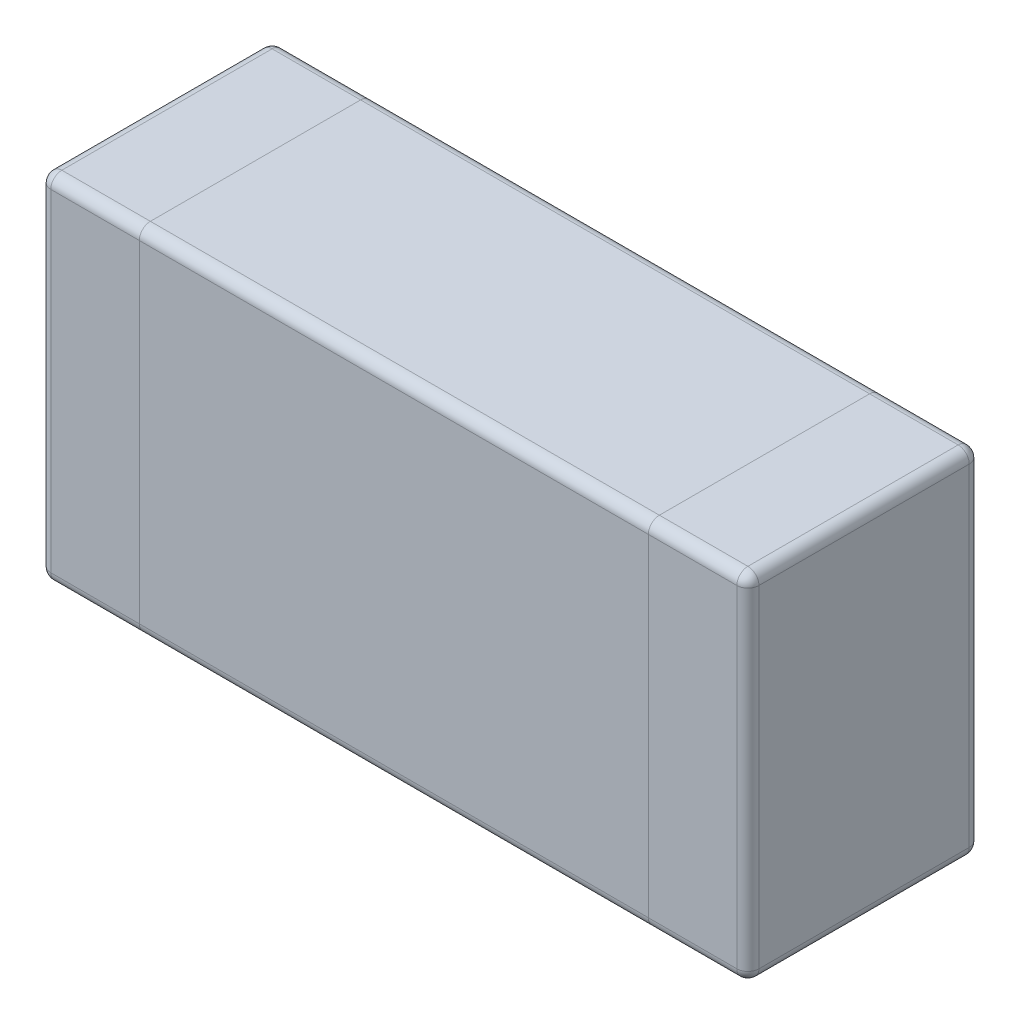
ISO-10303-21;
HEADER;
FILE_DESCRIPTION(('STEP AP214'),'2;1');
FILE_NAME('part.step','',(''),(''),'','','');
FILE_SCHEMA(('AUTOMOTIVE_DESIGN { 1 0 10303 214 1 1 1 1 }'));
ENDSEC;
DATA;
#1=APPLICATION_CONTEXT('core data for automotive mechanical design processes');
#2=APPLICATION_PROTOCOL_DEFINITION('international standard','automotive_design',2000,#1);
#3=PRODUCT_CONTEXT('',#1,'mechanical');
#4=PRODUCT('Part','Part','',(#3));
#5=PRODUCT_RELATED_PRODUCT_CATEGORY('part','',(#4));
#6=PRODUCT_DEFINITION_FORMATION('','',#4);
#7=PRODUCT_DEFINITION_CONTEXT('part definition',#1,'design');
#8=PRODUCT_DEFINITION('design','',#6,#7);
#9=PRODUCT_DEFINITION_SHAPE('','',#8);
#10=(LENGTH_UNIT() NAMED_UNIT(*) SI_UNIT(.MILLI.,.METRE.));
#11=(NAMED_UNIT(*) PLANE_ANGLE_UNIT() SI_UNIT($,.RADIAN.));
#12=(NAMED_UNIT(*) SI_UNIT($,.STERADIAN.) SOLID_ANGLE_UNIT());
#13=UNCERTAINTY_MEASURE_WITH_UNIT(LENGTH_MEASURE(1.E-05),#10,'distance_accuracy_value','');
#14=(GEOMETRIC_REPRESENTATION_CONTEXT(3) GLOBAL_UNCERTAINTY_ASSIGNED_CONTEXT((#13)) GLOBAL_UNIT_ASSIGNED_CONTEXT((#10,
#11,#12)) REPRESENTATION_CONTEXT('',''));
#15=CARTESIAN_POINT('',(0.,0.,0.));
#16=DIRECTION('',(0.,0.,1.));
#17=DIRECTION('',(1.,0.,0.));
#18=AXIS2_PLACEMENT_3D('',#15,#16,#17);
#19=CARTESIAN_POINT('',(1.55,0.749999999999718,1.0500000000002));
#20=DIRECTION('',(0.,2.68882138776405E-13,-1.));
#21=DIRECTION('',(0.,1.,2.68882138776405E-13));
#22=AXIS2_PLACEMENT_3D('',#19,#20,#21);
#23=CYLINDRICAL_SURFACE('',#22,0.05);
#24=CARTESIAN_POINT('',(1.55,0.749999999999731,1.0000000000002));
#25=DIRECTION('',(0.,2.68882138776405E-13,-1.));
#26=DIRECTION('',(0.,-1.,-2.68882138776405E-13));
#27=AXIS2_PLACEMENT_3D('',#24,#25,#26);
#28=CIRCLE('',#27,0.05);
#29=CARTESIAN_POINT('',(1.55,0.799999999999731,1.00000000000021));
#30=VERTEX_POINT('',#29);
#31=CARTESIAN_POINT('',(1.6,0.749999999999731,1.0000000000002));
#32=VERTEX_POINT('',#31);
#33=EDGE_CURVE('E25',#30,#32,#28,.T.);
#34=ORIENTED_EDGE('',*,*,#33,.T.);
#35=DIRECTION('',(0.,-2.68736422004423E-13,1.));
#36=VECTOR('',#35,1.);
#37=CARTESIAN_POINT('',(1.6,0.749999999999718,1.0500000000002));
#38=LINE('',#37,#36);
#39=CARTESIAN_POINT('',(1.6,0.749999999999987,0.0500000000002015));
#40=VERTEX_POINT('',#39);
#41=EDGE_CURVE('E376',#40,#32,#38,.T.);
#42=ORIENTED_EDGE('',*,*,#41,.F.);
#43=CARTESIAN_POINT('',(1.55,0.749999999999987,0.0500000000002015));
#44=DIRECTION('',(0.,-2.68746613504845E-13,1.));
#45=DIRECTION('',(0.,1.,2.68746613504845E-13));
#46=AXIS2_PLACEMENT_3D('',#43,#44,#45);
#47=CIRCLE('',#46,0.05);
#48=CARTESIAN_POINT('',(1.55,0.799999999999987,0.0500000000002149));
#49=VERTEX_POINT('',#48);
#50=EDGE_CURVE('E11',#40,#49,#47,.T.);
#51=ORIENTED_EDGE('',*,*,#50,.T.);
#52=DIRECTION('',(0.,2.68736422004423E-13,-1.));
#53=VECTOR('',#52,1.);
#54=CARTESIAN_POINT('',(1.55,0.799999999999718,1.05000000000021));
#55=LINE('',#54,#53);
#56=EDGE_CURVE('E277',#30,#49,#55,.T.);
#57=ORIENTED_EDGE('',*,*,#56,.F.);
#58=EDGE_LOOP('',(#34,#42,#51,#57));
#59=FACE_BOUND('',#58,.T.);
#60=ADVANCED_FACE('F17',(#59),#23,.T.);
#61=CARTESIAN_POINT('',(1.55,0.749999999999987,0.0500000000002016));
#62=DIRECTION('',(0.,-2.68736422004423E-13,1.));
#63=DIRECTION('',(1.,0.,0.));
#64=AXIS2_PLACEMENT_3D('',#61,#62,#63);
#65=SPHERICAL_SURFACE('',#64,0.05);
#66=CARTESIAN_POINT('',(1.55,0.749999999999987,0.0500000000002015));
#67=DIRECTION('',(0.,1.,2.68736422004423E-13));
#68=DIRECTION('',(-1.,0.,0.));
#69=AXIS2_PLACEMENT_3D('',#66,#67,#68);
#70=CIRCLE('',#69,0.05);
#71=CARTESIAN_POINT('',(1.55,0.75,2.01552316503317E-13));
#72=VERTEX_POINT('',#71);
#73=EDGE_CURVE('E428',#40,#72,#70,.T.);
#74=ORIENTED_EDGE('',*,*,#73,.T.);
#75=CARTESIAN_POINT('',(1.55,0.749999999999987,0.0500000000002016));
#76=DIRECTION('',(1.,0.,0.));
#77=DIRECTION('',(0.,1.,2.68746613504845E-13));
#78=AXIS2_PLACEMENT_3D('',#75,#76,#77);
#79=CIRCLE('',#78,0.05);
#80=EDGE_CURVE('E367',#72,#49,#79,.T.);
#81=ORIENTED_EDGE('',*,*,#80,.T.);
#82=ORIENTED_EDGE('',*,*,#50,.F.);
#83=EDGE_LOOP('',(#74,#81,#82));
#84=FACE_BOUND('',#83,.T.);
#85=ADVANCED_FACE('F467',(#84),#65,.T.);
#86=CARTESIAN_POINT('',(1.55,0.749999999999731,1.0000000000002));
#87=DIRECTION('',(0.,-2.68736422004423E-13,1.));
#88=DIRECTION('',(1.,0.,0.));
#89=AXIS2_PLACEMENT_3D('',#86,#87,#88);
#90=SPHERICAL_SURFACE('',#89,0.05);
#91=CARTESIAN_POINT('',(1.55,0.749999999999731,1.0000000000002));
#92=DIRECTION('',(1.,0.,0.));
#93=DIRECTION('',(0.,-2.68882138776406E-13,1.));
#94=AXIS2_PLACEMENT_3D('',#91,#92,#93);
#95=CIRCLE('',#94,0.05);
#96=CARTESIAN_POINT('',(1.55,0.749999999999718,1.0500000000002));
#97=VERTEX_POINT('',#96);
#98=EDGE_CURVE('E343',#30,#97,#95,.T.);
#99=ORIENTED_EDGE('',*,*,#98,.T.);
#100=CARTESIAN_POINT('',(1.55,0.749999999999731,1.0000000000002));
#101=DIRECTION('',(0.,1.,2.68736422004423E-13));
#102=DIRECTION('',(-1.,0.,0.));
#103=AXIS2_PLACEMENT_3D('',#100,#101,#102);
#104=CIRCLE('',#103,0.05);
#105=EDGE_CURVE('E431',#97,#32,#104,.T.);
#106=ORIENTED_EDGE('',*,*,#105,.T.);
#107=ORIENTED_EDGE('',*,*,#33,.F.);
#108=EDGE_LOOP('',(#99,#106,#107));
#109=FACE_BOUND('',#108,.T.);
#110=ADVANCED_FACE('F454',(#109),#90,.T.);
#111=CARTESIAN_POINT('',(1.55,-0.800000000000014,0.0499999999997849));
#112=DIRECTION('',(0.,-1.,-2.68736422004423E-13));
#113=DIRECTION('',(1.,0.,0.));
#114=AXIS2_PLACEMENT_3D('',#111,#112,#113);
#115=CYLINDRICAL_SURFACE('',#114,0.05);
#116=CARTESIAN_POINT('',(1.55,-0.750000000000014,0.0499999999997985));
#117=DIRECTION('',(0.,1.,2.68736422004423E-13));
#118=DIRECTION('',(1.,0.,0.));
#119=AXIS2_PLACEMENT_3D('',#116,#117,#118);
#120=CIRCLE('',#119,0.05);
#121=CARTESIAN_POINT('',(1.6,-0.750000000000014,0.0499999999997984));
#122=VERTEX_POINT('',#121);
#123=CARTESIAN_POINT('',(1.55,-0.75,-2.01552316503317E-13));
#124=VERTEX_POINT('',#123);
#125=EDGE_CURVE('E143',#122,#124,#120,.T.);
#126=ORIENTED_EDGE('',*,*,#125,.T.);
#127=DIRECTION('',(0.,-1.,-2.68736422004423E-13));
#128=VECTOR('',#127,1.);
#129=CARTESIAN_POINT('',(1.55,-0.8,-2.14989137603538E-13));
#130=LINE('',#129,#128);
#131=EDGE_CURVE('E279',#72,#124,#130,.T.);
#132=ORIENTED_EDGE('',*,*,#131,.F.);
#133=ORIENTED_EDGE('',*,*,#73,.F.);
#134=DIRECTION('',(0.,1.,2.68736422004423E-13));
#135=VECTOR('',#134,1.);
#136=CARTESIAN_POINT('',(1.6,0.799999999999987,0.0500000000002149));
#137=LINE('',#136,#135);
#138=EDGE_CURVE('E309',#122,#40,#137,.T.);
#139=ORIENTED_EDGE('',*,*,#138,.F.);
#140=EDGE_LOOP('',(#126,#132,#133,#139));
#141=FACE_BOUND('',#140,.T.);
#142=ADVANCED_FACE('F463',(#141),#115,.T.);
#143=CARTESIAN_POINT('',(-1.6,0.749999999999987,0.0500000000002015));
#144=DIRECTION('',(1.,0.,0.));
#145=DIRECTION('',(0.,1.,2.68746613504845E-13));
#146=AXIS2_PLACEMENT_3D('',#143,#144,#145);
#147=CYLINDRICAL_SURFACE('',#146,0.05);
#148=CARTESIAN_POINT('',(-1.15,0.749999999999987,0.0500000000002015));
#149=DIRECTION('',(-1.,0.,0.));
#150=DIRECTION('',(0.,1.,2.68746613504845E-13));
#151=AXIS2_PLACEMENT_3D('',#148,#149,#150);
#152=CIRCLE('',#151,0.05);
#153=CARTESIAN_POINT('',(-1.15,0.799999999999987,0.0500000000002149));
#154=VERTEX_POINT('',#153);
#155=CARTESIAN_POINT('',(-1.15,0.75,2.01552316503317E-13));
#156=VERTEX_POINT('',#155);
#157=EDGE_CURVE('E351',#154,#156,#152,.T.);
#158=ORIENTED_EDGE('',*,*,#157,.F.);
#159=DIRECTION('',(-1.,0.,0.));
#160=VECTOR('',#159,1.);
#161=CARTESIAN_POINT('',(-1.6,0.799999999999987,0.0500000000002149));
#162=LINE('',#161,#160);
#163=CARTESIAN_POINT('',(1.15,0.799999999999987,0.0500000000002149));
#164=VERTEX_POINT('',#163);
#165=EDGE_CURVE('E313',#164,#154,#162,.T.);
#166=ORIENTED_EDGE('',*,*,#165,.F.);
#167=CARTESIAN_POINT('',(1.15,0.749999999999987,0.0500000000002015));
#168=DIRECTION('',(1.,0.,0.));
#169=DIRECTION('',(0.,-1.,-2.68746613504845E-13));
#170=AXIS2_PLACEMENT_3D('',#167,#168,#169);
#171=CIRCLE('',#170,0.05);
#172=CARTESIAN_POINT('',(1.15,0.75,2.01552316503317E-13));
#173=VERTEX_POINT('',#172);
#174=EDGE_CURVE('E359',#173,#164,#171,.T.);
#175=ORIENTED_EDGE('',*,*,#174,.F.);
#176=DIRECTION('',(1.,0.,0.));
#177=VECTOR('',#176,1.);
#178=CARTESIAN_POINT('',(1.6,0.75,2.01552316503317E-13));
#179=LINE('',#178,#177);
#180=EDGE_CURVE('E397',#156,#173,#179,.T.);
#181=ORIENTED_EDGE('',*,*,#180,.F.);
#182=EDGE_LOOP('',(#158,#166,#175,#181));
#183=FACE_BOUND('',#182,.T.);
#184=ADVANCED_FACE('F1278',(#183),#147,.T.);
#185=CARTESIAN_POINT('',(1.6,0.749999999999731,1.0000000000002));
#186=DIRECTION('',(-1.,0.,0.));
#187=DIRECTION('',(0.,-1.,-2.68882138776405E-13));
#188=AXIS2_PLACEMENT_3D('',#185,#186,#187);
#189=CYLINDRICAL_SURFACE('',#188,0.05);
#190=CARTESIAN_POINT('',(-1.15,0.749999999999731,1.0000000000002));
#191=DIRECTION('',(-1.,0.,0.));
#192=DIRECTION('',(0.,1.,2.68882138776405E-13));
#193=AXIS2_PLACEMENT_3D('',#190,#191,#192);
#194=CIRCLE('',#193,0.05);
#195=CARTESIAN_POINT('',(-1.15,0.749999999999718,1.0500000000002));
#196=VERTEX_POINT('',#195);
#197=CARTESIAN_POINT('',(-1.15,0.799999999999731,1.00000000000021));
#198=VERTEX_POINT('',#197);
#199=EDGE_CURVE('E283',#196,#198,#194,.T.);
#200=ORIENTED_EDGE('',*,*,#199,.F.);
#201=DIRECTION('',(-1.,0.,0.));
#202=VECTOR('',#201,1.);
#203=CARTESIAN_POINT('',(1.6,0.749999999999718,1.0500000000002));
#204=LINE('',#203,#202);
#205=CARTESIAN_POINT('',(1.15,0.749999999999718,1.0500000000002));
#206=VERTEX_POINT('',#205);
#207=EDGE_CURVE('E227',#206,#196,#204,.T.);
#208=ORIENTED_EDGE('',*,*,#207,.F.);
#209=CARTESIAN_POINT('',(1.15,0.749999999999731,1.0000000000002));
#210=DIRECTION('',(1.,0.,0.));
#211=DIRECTION('',(0.,-1.,-2.68882138776405E-13));
#212=AXIS2_PLACEMENT_3D('',#209,#210,#211);
#213=CIRCLE('',#212,0.05);
#214=CARTESIAN_POINT('',(1.15,0.799999999999731,1.00000000000021));
#215=VERTEX_POINT('',#214);
#216=EDGE_CURVE('E339',#215,#206,#213,.T.);
#217=ORIENTED_EDGE('',*,*,#216,.F.);
#218=DIRECTION('',(1.,0.,0.));
#219=VECTOR('',#218,1.);
#220=CARTESIAN_POINT('',(-1.6,0.799999999999731,1.00000000000021));
#221=LINE('',#220,#219);
#222=EDGE_CURVE('E335',#198,#215,#221,.T.);
#223=ORIENTED_EDGE('',*,*,#222,.F.);
#224=EDGE_LOOP('',(#200,#208,#217,#223));
#225=FACE_BOUND('',#224,.T.);
#226=ADVANCED_FACE('F1270',(#225),#189,.T.);
#227=CARTESIAN_POINT('',(1.55,0.799999999999731,1.00000000000021));
#228=DIRECTION('',(0.,1.,2.68736422004423E-13));
#229=DIRECTION('',(-1.,0.,0.));
#230=AXIS2_PLACEMENT_3D('',#227,#228,#229);
#231=CYLINDRICAL_SURFACE('',#230,0.05);
#232=CARTESIAN_POINT('',(1.55,-0.750000000000269,0.999999999999799));
#233=DIRECTION('',(0.,1.,2.71050543121376E-13));
#234=DIRECTION('',(0.,2.71050543121376E-13,-1.));
#235=AXIS2_PLACEMENT_3D('',#232,#233,#234);
#236=CIRCLE('',#235,0.05);
#237=CARTESIAN_POINT('',(1.55,-0.750000000000283,1.0499999999998));
#238=VERTEX_POINT('',#237);
#239=CARTESIAN_POINT('',(1.6,-0.750000000000269,0.999999999999799));
#240=VERTEX_POINT('',#239);
#241=EDGE_CURVE('E157',#238,#240,#236,.T.);
#242=ORIENTED_EDGE('',*,*,#241,.T.);
#243=DIRECTION('',(0.,-1.,-2.68736422004423E-13));
#244=VECTOR('',#243,1.);
#245=CARTESIAN_POINT('',(1.6,-0.800000000000269,0.999999999999786));
#246=LINE('',#245,#244);
#247=EDGE_CURVE('E375',#32,#240,#246,.T.);
#248=ORIENTED_EDGE('',*,*,#247,.F.);
#249=ORIENTED_EDGE('',*,*,#105,.F.);
#250=DIRECTION('',(0.,1.,2.68736422004423E-13));
#251=VECTOR('',#250,1.);
#252=CARTESIAN_POINT('',(1.55,0.799999999999718,1.05000000000021));
#253=LINE('',#252,#251);
#254=EDGE_CURVE('E488',#238,#97,#253,.T.);
#255=ORIENTED_EDGE('',*,*,#254,.F.);
#256=EDGE_LOOP('',(#242,#248,#249,#255));
#257=FACE_BOUND('',#256,.T.);
#258=ADVANCED_FACE('F456',(#257),#231,.T.);
#259=CARTESIAN_POINT('',(1.55,-0.750000000000014,0.0499999999997985));
#260=DIRECTION('',(0.,-2.68736422004423E-13,1.));
#261=DIRECTION('',(1.,0.,0.));
#262=AXIS2_PLACEMENT_3D('',#259,#260,#261);
#263=SPHERICAL_SURFACE('',#262,0.05);
#264=CARTESIAN_POINT('',(1.55,-0.750000000000014,0.0499999999997984));
#265=DIRECTION('',(0.,2.68746613504845E-13,-1.));
#266=DIRECTION('',(0.,1.,2.68746613504845E-13));
#267=AXIS2_PLACEMENT_3D('',#264,#265,#266);
#268=CIRCLE('',#267,0.05);
#269=CARTESIAN_POINT('',(1.55,-0.800000000000014,0.0499999999997849));
#270=VERTEX_POINT('',#269);
#271=EDGE_CURVE('E437',#122,#270,#268,.T.);
#272=ORIENTED_EDGE('',*,*,#271,.T.);
#273=CARTESIAN_POINT('',(1.55,-0.750000000000014,0.0499999999997984));
#274=DIRECTION('',(1.,0.,0.));
#275=DIRECTION('',(0.,1.,2.68746613504845E-13));
#276=AXIS2_PLACEMENT_3D('',#273,#274,#275);
#277=CIRCLE('',#276,0.05);
#278=EDGE_CURVE('E246',#270,#124,#277,.T.);
#279=ORIENTED_EDGE('',*,*,#278,.T.);
#280=ORIENTED_EDGE('',*,*,#125,.F.);
#281=EDGE_LOOP('',(#272,#279,#280));
#282=FACE_BOUND('',#281,.T.);
#283=ADVANCED_FACE('F1147',(#282),#263,.T.);
#284=CARTESIAN_POINT('',(-1.55,0.749999999999987,0.0500000000002016));
#285=DIRECTION('',(0.,-2.68736422004423E-13,1.));
#286=DIRECTION('',(1.,0.,0.));
#287=AXIS2_PLACEMENT_3D('',#284,#285,#286);
#288=SPHERICAL_SURFACE('',#287,0.05);
#289=CARTESIAN_POINT('',(-1.55,0.749999999999987,0.0500000000002016));
#290=DIRECTION('',(0.,1.,2.68736422004423E-13));
#291=DIRECTION('',(-1.,0.,0.));
#292=AXIS2_PLACEMENT_3D('',#289,#290,#291);
#293=CIRCLE('',#292,0.05);
#294=CARTESIAN_POINT('',(-1.55,0.75,2.01552316503317E-13));
#295=VERTEX_POINT('',#294);
#296=CARTESIAN_POINT('',(-1.6,0.749999999999987,0.0500000000002015));
#297=VERTEX_POINT('',#296);
#298=EDGE_CURVE('E38',#295,#297,#293,.T.);
#299=ORIENTED_EDGE('',*,*,#298,.T.);
#300=CARTESIAN_POINT('',(-1.55,0.749999999999987,0.0500000000002015));
#301=DIRECTION('',(0.,2.68746613504845E-13,-1.));
#302=DIRECTION('',(0.,1.,2.68746613504845E-13));
#303=AXIS2_PLACEMENT_3D('',#300,#301,#302);
#304=CIRCLE('',#303,0.05);
#305=CARTESIAN_POINT('',(-1.55,0.799999999999987,0.0500000000002149));
#306=VERTEX_POINT('',#305);
#307=EDGE_CURVE('E385',#297,#306,#304,.T.);
#308=ORIENTED_EDGE('',*,*,#307,.T.);
#309=CARTESIAN_POINT('',(-1.55,0.749999999999987,0.0500000000002015));
#310=DIRECTION('',(1.,0.,0.));
#311=DIRECTION('',(0.,-1.,-2.68746613504845E-13));
#312=AXIS2_PLACEMENT_3D('',#309,#310,#311);
#313=CIRCLE('',#312,0.05);
#314=EDGE_CURVE('E355',#295,#306,#313,.T.);
#315=ORIENTED_EDGE('',*,*,#314,.F.);
#316=EDGE_LOOP('',(#299,#308,#315));
#317=FACE_BOUND('',#316,.T.);
#318=ADVANCED_FACE('F572',(#317),#288,.T.);
#319=CARTESIAN_POINT('',(-1.55,0.749999999999731,1.0000000000002));
#320=DIRECTION('',(0.,-2.68736422004423E-13,1.));
#321=DIRECTION('',(1.,0.,0.));
#322=AXIS2_PLACEMENT_3D('',#319,#320,#321);
#323=SPHERICAL_SURFACE('',#322,0.05);
#324=CARTESIAN_POINT('',(-1.55,0.749999999999731,1.0000000000002));
#325=DIRECTION('',(0.,-2.68882138776405E-13,1.));
#326=DIRECTION('',(0.,-1.,-2.68882138776405E-13));
#327=AXIS2_PLACEMENT_3D('',#324,#325,#326);
#328=CIRCLE('',#327,0.05);
#329=CARTESIAN_POINT('',(-1.55,0.799999999999731,1.00000000000021));
#330=VERTEX_POINT('',#329);
#331=CARTESIAN_POINT('',(-1.6,0.749999999999732,1.0000000000002));
#332=VERTEX_POINT('',#331);
#333=EDGE_CURVE('E52',#330,#332,#328,.T.);
#334=ORIENTED_EDGE('',*,*,#333,.T.);
#335=CARTESIAN_POINT('',(-1.55,0.749999999999732,1.0000000000002));
#336=DIRECTION('',(0.,1.,2.71050543121376E-13));
#337=DIRECTION('',(0.,-2.71050543121376E-13,1.));
#338=AXIS2_PLACEMENT_3D('',#335,#336,#337);
#339=CIRCLE('',#338,0.05);
#340=CARTESIAN_POINT('',(-1.55,0.749999999999718,1.0500000000002));
#341=VERTEX_POINT('',#340);
#342=EDGE_CURVE('E268',#332,#341,#339,.T.);
#343=ORIENTED_EDGE('',*,*,#342,.T.);
#344=CARTESIAN_POINT('',(-1.55,0.749999999999731,1.0000000000002));
#345=DIRECTION('',(1.,0.,0.));
#346=DIRECTION('',(0.,-1.,-2.68882138776405E-13));
#347=AXIS2_PLACEMENT_3D('',#344,#345,#346);
#348=CIRCLE('',#347,0.05);
#349=EDGE_CURVE('E325',#330,#341,#348,.T.);
#350=ORIENTED_EDGE('',*,*,#349,.F.);
#351=EDGE_LOOP('',(#334,#343,#350));
#352=FACE_BOUND('',#351,.T.);
#353=ADVANCED_FACE('F1247',(#352),#323,.T.);
#354=CARTESIAN_POINT('',(1.55,-0.750000000000269,0.999999999999799));
#355=DIRECTION('',(0.,-2.68736422004423E-13,1.));
#356=DIRECTION('',(1.,0.,0.));
#357=AXIS2_PLACEMENT_3D('',#354,#355,#356);
#358=SPHERICAL_SURFACE('',#357,0.05);
#359=CARTESIAN_POINT('',(1.55,-0.750000000000269,0.999999999999799));
#360=DIRECTION('',(1.,0.,0.));
#361=DIRECTION('',(0.,1.,2.68882138776405E-13));
#362=AXIS2_PLACEMENT_3D('',#359,#360,#361);
#363=CIRCLE('',#362,0.05);
#364=CARTESIAN_POINT('',(1.55,-0.800000000000269,0.999999999999786));
#365=VERTEX_POINT('',#364);
#366=EDGE_CURVE('E515',#238,#365,#363,.T.);
#367=ORIENTED_EDGE('',*,*,#366,.T.);
#368=CARTESIAN_POINT('',(1.55,-0.750000000000269,0.999999999999799));
#369=DIRECTION('',(0.,-2.68882138776405E-13,1.));
#370=DIRECTION('',(0.,-1.,-2.68882138776405E-13));
#371=AXIS2_PLACEMENT_3D('',#368,#369,#370);
#372=CIRCLE('',#371,0.05);
#373=EDGE_CURVE('E434',#365,#240,#372,.T.);
#374=ORIENTED_EDGE('',*,*,#373,.T.);
#375=ORIENTED_EDGE('',*,*,#241,.F.);
#376=EDGE_LOOP('',(#367,#374,#375));
#377=FACE_BOUND('',#376,.T.);
#378=ADVANCED_FACE('F1238',(#377),#358,.T.);
#379=CARTESIAN_POINT('',(1.55,-0.750000000000283,1.0499999999998));
#380=DIRECTION('',(0.,2.68882138776405E-13,-1.));
#381=DIRECTION('',(0.,1.,2.68882138776405E-13));
#382=AXIS2_PLACEMENT_3D('',#379,#380,#381);
#383=CYLINDRICAL_SURFACE('',#382,0.05);
#384=ORIENTED_EDGE('',*,*,#373,.F.);
#385=DIRECTION('',(0.,-2.68736422004423E-13,1.));
#386=VECTOR('',#385,1.);
#387=CARTESIAN_POINT('',(1.55,-0.800000000000282,1.04999999999979));
#388=LINE('',#387,#386);
#389=EDGE_CURVE('E251',#270,#365,#388,.T.);
#390=ORIENTED_EDGE('',*,*,#389,.F.);
#391=ORIENTED_EDGE('',*,*,#271,.F.);
#392=DIRECTION('',(0.,2.68736422004423E-13,-1.));
#393=VECTOR('',#392,1.);
#394=CARTESIAN_POINT('',(1.6,-0.750000000000283,1.0499999999998));
#395=LINE('',#394,#393);
#396=EDGE_CURVE('E314',#240,#122,#395,.T.);
#397=ORIENTED_EDGE('',*,*,#396,.F.);
#398=EDGE_LOOP('',(#384,#390,#391,#397));
#399=FACE_BOUND('',#398,.T.);
#400=ADVANCED_FACE('F1230',(#399),#383,.T.);
#401=CARTESIAN_POINT('',(-1.6,-0.750000000000014,0.0499999999997984));
#402=DIRECTION('',(-1.,0.,0.));
#403=DIRECTION('',(0.,-1.,-2.68746613504845E-13));
#404=AXIS2_PLACEMENT_3D('',#401,#402,#403);
#405=CYLINDRICAL_SURFACE('',#404,0.05);
#406=CARTESIAN_POINT('',(-1.15,-0.750000000000014,0.0499999999997984));
#407=DIRECTION('',(-1.,0.,0.));
#408=DIRECTION('',(0.,1.,2.68746613504845E-13));
#409=AXIS2_PLACEMENT_3D('',#406,#407,#408);
#410=CIRCLE('',#409,0.05);
#411=CARTESIAN_POINT('',(-1.15,-0.75,-2.01552316503317E-13));
#412=VERTEX_POINT('',#411);
#413=CARTESIAN_POINT('',(-1.15,-0.800000000000014,0.0499999999997849));
#414=VERTEX_POINT('',#413);
#415=EDGE_CURVE('E288',#412,#414,#410,.T.);
#416=ORIENTED_EDGE('',*,*,#415,.F.);
#417=DIRECTION('',(-1.,0.,0.));
#418=VECTOR('',#417,1.);
#419=CARTESIAN_POINT('',(-1.6,-0.75,-2.01552316503317E-13));
#420=LINE('',#419,#418);
#421=CARTESIAN_POINT('',(1.15,-0.75,-2.01552316503317E-13));
#422=VERTEX_POINT('',#421);
#423=EDGE_CURVE('E234',#422,#412,#420,.T.);
#424=ORIENTED_EDGE('',*,*,#423,.F.);
#425=CARTESIAN_POINT('',(1.15,-0.750000000000014,0.0499999999997984));
#426=DIRECTION('',(1.,0.,0.));
#427=DIRECTION('',(0.,-1.,-2.68746613504845E-13));
#428=AXIS2_PLACEMENT_3D('',#425,#426,#427);
#429=CIRCLE('',#428,0.05);
#430=CARTESIAN_POINT('',(1.15,-0.800000000000014,0.0499999999997849));
#431=VERTEX_POINT('',#430);
#432=EDGE_CURVE('E231',#431,#422,#429,.T.);
#433=ORIENTED_EDGE('',*,*,#432,.F.);
#434=DIRECTION('',(1.,0.,0.));
#435=VECTOR('',#434,1.);
#436=CARTESIAN_POINT('',(1.6,-0.800000000000014,0.0499999999997849));
#437=LINE('',#436,#435);
#438=EDGE_CURVE('E214',#414,#431,#437,.T.);
#439=ORIENTED_EDGE('',*,*,#438,.F.);
#440=EDGE_LOOP('',(#416,#424,#433,#439));
#441=FACE_BOUND('',#440,.T.);
#442=ADVANCED_FACE('F233',(#441),#405,.T.);
#443=CARTESIAN_POINT('',(-1.55,-0.800000000000014,0.0499999999997849));
#444=DIRECTION('',(0.,1.,2.68736422004423E-13));
#445=DIRECTION('',(-1.,0.,0.));
#446=AXIS2_PLACEMENT_3D('',#443,#444,#445);
#447=CYLINDRICAL_SURFACE('',#446,0.05);
#448=CARTESIAN_POINT('',(-1.55,-0.750000000000014,0.0499999999997984));
#449=DIRECTION('',(0.,1.,2.68736422004423E-13));
#450=DIRECTION('',(1.,0.,0.));
#451=AXIS2_PLACEMENT_3D('',#448,#449,#450);
#452=CIRCLE('',#451,0.05);
#453=CARTESIAN_POINT('',(-1.55,-0.75,-2.01552316503317E-13));
#454=VERTEX_POINT('',#453);
#455=CARTESIAN_POINT('',(-1.6,-0.750000000000014,0.0499999999997984));
#456=VERTEX_POINT('',#455);
#457=EDGE_CURVE('E425',#454,#456,#452,.T.);
#458=ORIENTED_EDGE('',*,*,#457,.T.);
#459=DIRECTION('',(0.,-1.,-2.68736422004423E-13));
#460=VECTOR('',#459,1.);
#461=CARTESIAN_POINT('',(-1.6,-0.800000000000014,0.0499999999997849));
#462=LINE('',#461,#460);
#463=EDGE_CURVE('E410',#297,#456,#462,.T.);
#464=ORIENTED_EDGE('',*,*,#463,.F.);
#465=ORIENTED_EDGE('',*,*,#298,.F.);
#466=DIRECTION('',(0.,1.,2.68736422004423E-13));
#467=VECTOR('',#466,1.);
#468=CARTESIAN_POINT('',(-1.55,0.8,2.14989137603538E-13));
#469=LINE('',#468,#467);
#470=EDGE_CURVE('E304',#454,#295,#469,.T.);
#471=ORIENTED_EDGE('',*,*,#470,.F.);
#472=EDGE_LOOP('',(#458,#464,#465,#471));
#473=FACE_BOUND('',#472,.T.);
#474=ADVANCED_FACE('F1184',(#473),#447,.T.);
#475=CARTESIAN_POINT('',(-1.55,0.749999999999718,1.0500000000002));
#476=DIRECTION('',(0.,2.68882138776405E-13,-1.));
#477=DIRECTION('',(0.,1.,2.68882138776405E-13));
#478=AXIS2_PLACEMENT_3D('',#475,#476,#477);
#479=CYLINDRICAL_SURFACE('',#478,0.05);
#480=ORIENTED_EDGE('',*,*,#307,.F.);
#481=DIRECTION('',(0.,2.68736422004423E-13,-1.));
#482=VECTOR('',#481,1.);
#483=CARTESIAN_POINT('',(-1.6,0.749999999999718,1.0500000000002));
#484=LINE('',#483,#482);
#485=EDGE_CURVE('E406',#332,#297,#484,.T.);
#486=ORIENTED_EDGE('',*,*,#485,.F.);
#487=ORIENTED_EDGE('',*,*,#333,.F.);
#488=DIRECTION('',(0.,-2.68736422004423E-13,1.));
#489=VECTOR('',#488,1.);
#490=CARTESIAN_POINT('',(-1.55,0.799999999999718,1.05000000000021));
#491=LINE('',#490,#489);
#492=EDGE_CURVE('E278',#306,#330,#491,.T.);
#493=ORIENTED_EDGE('',*,*,#492,.F.);
#494=EDGE_LOOP('',(#480,#486,#487,#493));
#495=FACE_BOUND('',#494,.T.);
#496=ADVANCED_FACE('F570',(#495),#479,.T.);
#497=CARTESIAN_POINT('',(-1.55,0.799999999999731,1.00000000000021));
#498=DIRECTION('',(0.,-1.,-2.68736422004423E-13));
#499=DIRECTION('',(1.,0.,0.));
#500=AXIS2_PLACEMENT_3D('',#497,#498,#499);
#501=CYLINDRICAL_SURFACE('',#500,0.05);
#502=CARTESIAN_POINT('',(-1.55,-0.750000000000269,0.999999999999799));
#503=DIRECTION('',(0.,1.,2.68736422004423E-13));
#504=DIRECTION('',(1.,0.,0.));
#505=AXIS2_PLACEMENT_3D('',#502,#503,#504);
#506=CIRCLE('',#505,0.05);
#507=CARTESIAN_POINT('',(-1.6,-0.750000000000269,0.999999999999799));
#508=VERTEX_POINT('',#507);
#509=CARTESIAN_POINT('',(-1.55,-0.750000000000283,1.0499999999998));
#510=VERTEX_POINT('',#509);
#511=EDGE_CURVE('E422',#508,#510,#506,.T.);
#512=ORIENTED_EDGE('',*,*,#511,.T.);
#513=DIRECTION('',(0.,-1.,-2.68736422004423E-13));
#514=VECTOR('',#513,1.);
#515=CARTESIAN_POINT('',(-1.55,0.799999999999718,1.05000000000021));
#516=LINE('',#515,#514);
#517=EDGE_CURVE('E566',#341,#510,#516,.T.);
#518=ORIENTED_EDGE('',*,*,#517,.F.);
#519=ORIENTED_EDGE('',*,*,#342,.F.);
#520=DIRECTION('',(0.,1.,2.68736422004423E-13));
#521=VECTOR('',#520,1.);
#522=CARTESIAN_POINT('',(-1.6,-0.800000000000269,0.999999999999786));
#523=LINE('',#522,#521);
#524=EDGE_CURVE('E334',#508,#332,#523,.T.);
#525=ORIENTED_EDGE('',*,*,#524,.F.);
#526=EDGE_LOOP('',(#512,#518,#519,#525));
#527=FACE_BOUND('',#526,.T.);
#528=ADVANCED_FACE('F563',(#527),#501,.T.);
#529=CARTESIAN_POINT('',(1.6,-0.750000000000269,0.999999999999799));
#530=DIRECTION('',(1.,0.,0.));
#531=DIRECTION('',(0.,1.,2.68882138776405E-13));
#532=AXIS2_PLACEMENT_3D('',#529,#530,#531);
#533=CYLINDRICAL_SURFACE('',#532,0.05);
#534=CARTESIAN_POINT('',(-1.15,-0.750000000000269,0.999999999999799));
#535=DIRECTION('',(-1.,0.,0.));
#536=DIRECTION('',(0.,1.,2.68882138776405E-13));
#537=AXIS2_PLACEMENT_3D('',#534,#535,#536);
#538=CIRCLE('',#537,0.05);
#539=CARTESIAN_POINT('',(-1.15,-0.800000000000269,0.999999999999786));
#540=VERTEX_POINT('',#539);
#541=CARTESIAN_POINT('',(-1.15,-0.750000000000283,1.0499999999998));
#542=VERTEX_POINT('',#541);
#543=EDGE_CURVE('E503',#540,#542,#538,.T.);
#544=ORIENTED_EDGE('',*,*,#543,.F.);
#545=DIRECTION('',(-1.,0.,0.));
#546=VECTOR('',#545,1.);
#547=CARTESIAN_POINT('',(-1.6,-0.800000000000269,0.999999999999786));
#548=LINE('',#547,#546);
#549=CARTESIAN_POINT('',(1.15,-0.800000000000269,0.999999999999786));
#550=VERTEX_POINT('',#549);
#551=EDGE_CURVE('E228',#550,#540,#548,.T.);
#552=ORIENTED_EDGE('',*,*,#551,.F.);
#553=CARTESIAN_POINT('',(1.15,-0.750000000000269,0.999999999999799));
#554=DIRECTION('',(1.,0.,0.));
#555=DIRECTION('',(0.,-1.,-2.68882138776405E-13));
#556=AXIS2_PLACEMENT_3D('',#553,#554,#555);
#557=CIRCLE('',#556,0.05);
#558=CARTESIAN_POINT('',(1.15,-0.750000000000283,1.0499999999998));
#559=VERTEX_POINT('',#558);
#560=EDGE_CURVE('E508',#559,#550,#557,.T.);
#561=ORIENTED_EDGE('',*,*,#560,.F.);
#562=DIRECTION('',(1.,0.,0.));
#563=VECTOR('',#562,1.);
#564=CARTESIAN_POINT('',(1.6,-0.750000000000283,1.0499999999998));
#565=LINE('',#564,#563);
#566=EDGE_CURVE('E400',#542,#559,#565,.T.);
#567=ORIENTED_EDGE('',*,*,#566,.F.);
#568=EDGE_LOOP('',(#544,#552,#561,#567));
#569=FACE_BOUND('',#568,.T.);
#570=ADVANCED_FACE('F592',(#569),#533,.T.);
#571=CARTESIAN_POINT('',(-1.55,-0.750000000000014,0.0499999999997985));
#572=DIRECTION('',(0.,-2.68736422004423E-13,1.));
#573=DIRECTION('',(1.,0.,0.));
#574=AXIS2_PLACEMENT_3D('',#571,#572,#573);
#575=SPHERICAL_SURFACE('',#574,0.05);
#576=CARTESIAN_POINT('',(-1.55,-0.750000000000014,0.0499999999997985));
#577=DIRECTION('',(1.,0.,0.));
#578=DIRECTION('',(0.,-1.,-2.70508442035133E-13));
#579=AXIS2_PLACEMENT_3D('',#576,#577,#578);
#580=CIRCLE('',#579,0.05);
#581=CARTESIAN_POINT('',(-1.55,-0.800000000000014,0.0499999999997849));
#582=VERTEX_POINT('',#581);
#583=EDGE_CURVE('E240',#582,#454,#580,.T.);
#584=ORIENTED_EDGE('',*,*,#583,.F.);
#585=CARTESIAN_POINT('',(-1.55,-0.750000000000014,0.0499999999997984));
#586=DIRECTION('',(0.,2.68746613504845E-13,-1.));
#587=DIRECTION('',(0.,1.,2.68746613504845E-13));
#588=AXIS2_PLACEMENT_3D('',#585,#586,#587);
#589=CIRCLE('',#588,0.05);
#590=EDGE_CURVE('E421',#582,#456,#589,.T.);
#591=ORIENTED_EDGE('',*,*,#590,.T.);
#592=ORIENTED_EDGE('',*,*,#457,.F.);
#593=EDGE_LOOP('',(#584,#591,#592));
#594=FACE_BOUND('',#593,.T.);
#595=ADVANCED_FACE('F547',(#594),#575,.T.);
#596=CARTESIAN_POINT('',(-1.55,-0.750000000000269,0.999999999999799));
#597=DIRECTION('',(0.,-2.68736422004423E-13,1.));
#598=DIRECTION('',(1.,0.,0.));
#599=AXIS2_PLACEMENT_3D('',#596,#597,#598);
#600=SPHERICAL_SURFACE('',#599,0.05);
#601=ORIENTED_EDGE('',*,*,#511,.F.);
#602=CARTESIAN_POINT('',(-1.55,-0.750000000000269,0.999999999999799));
#603=DIRECTION('',(0.,-2.68882138776405E-13,1.));
#604=DIRECTION('',(0.,-1.,-2.68882138776405E-13));
#605=AXIS2_PLACEMENT_3D('',#602,#603,#604);
#606=CIRCLE('',#605,0.05);
#607=CARTESIAN_POINT('',(-1.55,-0.800000000000269,0.999999999999786));
#608=VERTEX_POINT('',#607);
#609=EDGE_CURVE('E418',#508,#608,#606,.T.);
#610=ORIENTED_EDGE('',*,*,#609,.T.);
#611=CARTESIAN_POINT('',(-1.55,-0.750000000000269,0.999999999999799));
#612=DIRECTION('',(1.,0.,0.));
#613=DIRECTION('',(0.,2.68882138776405E-13,-1.));
#614=AXIS2_PLACEMENT_3D('',#611,#612,#613);
#615=CIRCLE('',#614,0.05);
#616=EDGE_CURVE('E510',#510,#608,#615,.T.);
#617=ORIENTED_EDGE('',*,*,#616,.F.);
#618=EDGE_LOOP('',(#601,#610,#617));
#619=FACE_BOUND('',#618,.T.);
#620=ADVANCED_FACE('F1179',(#619),#600,.T.);
#621=CARTESIAN_POINT('',(-1.55,-0.750000000000283,1.0499999999998));
#622=DIRECTION('',(0.,2.68882138776405E-13,-1.));
#623=DIRECTION('',(0.,1.,2.68882138776405E-13));
#624=AXIS2_PLACEMENT_3D('',#621,#622,#623);
#625=CYLINDRICAL_SURFACE('',#624,0.05);
#626=ORIENTED_EDGE('',*,*,#609,.F.);
#627=DIRECTION('',(0.,-2.68736422004423E-13,1.));
#628=VECTOR('',#627,1.);
#629=CARTESIAN_POINT('',(-1.6,-0.750000000000283,1.0499999999998));
#630=LINE('',#629,#628);
#631=EDGE_CURVE('E330',#456,#508,#630,.T.);
#632=ORIENTED_EDGE('',*,*,#631,.F.);
#633=ORIENTED_EDGE('',*,*,#590,.F.);
#634=DIRECTION('',(0.,2.68736422004423E-13,-1.));
#635=VECTOR('',#634,1.);
#636=CARTESIAN_POINT('',(-1.55,-0.800000000000282,1.04999999999979));
#637=LINE('',#636,#635);
#638=EDGE_CURVE('E265',#608,#582,#637,.T.);
#639=ORIENTED_EDGE('',*,*,#638,.F.);
#640=EDGE_LOOP('',(#626,#632,#633,#639));
#641=FACE_BOUND('',#640,.T.);
#642=ADVANCED_FACE('F558',(#641),#625,.T.);
#643=CARTESIAN_POINT('',(1.6,0.8,2.14989137603538E-13));
#644=DIRECTION('',(0.,2.68736422004423E-13,-1.));
#645=DIRECTION('',(-1.,0.,0.));
#646=AXIS2_PLACEMENT_3D('',#643,#644,#645);
#647=PLANE('',#646);
#648=DIRECTION('',(0.,-1.,-2.68736422004423E-13));
#649=VECTOR('',#648,1.);
#650=CARTESIAN_POINT('',(-1.15,0.8,2.14989137603538E-13));
#651=LINE('',#650,#649);
#652=EDGE_CURVE('E300',#156,#412,#651,.T.);
#653=ORIENTED_EDGE('',*,*,#652,.F.);
#654=ORIENTED_EDGE('',*,*,#180,.T.);
#655=DIRECTION('',(0.,1.,2.68736422004423E-13));
#656=VECTOR('',#655,1.);
#657=CARTESIAN_POINT('',(1.15,0.8,2.14989137603538E-13));
#658=LINE('',#657,#656);
#659=EDGE_CURVE('E308',#422,#173,#658,.T.);
#660=ORIENTED_EDGE('',*,*,#659,.F.);
#661=ORIENTED_EDGE('',*,*,#423,.T.);
#662=EDGE_LOOP('',(#653,#654,#660,#661));
#663=FACE_BOUND('',#662,.T.);
#664=ADVANCED_FACE('F584',(#663),#647,.T.);
#665=CARTESIAN_POINT('',(1.6,0.799999999999718,1.05000000000021));
#666=DIRECTION('',(0.,2.68736422004423E-13,-1.));
#667=DIRECTION('',(-1.,0.,0.));
#668=AXIS2_PLACEMENT_3D('',#665,#666,#667);
#669=PLANE('',#668);
#670=ORIENTED_EDGE('',*,*,#207,.T.);
#671=DIRECTION('',(0.,-1.,-2.68736422004423E-13));
#672=VECTOR('',#671,1.);
#673=CARTESIAN_POINT('',(-1.15,0.799999999999718,1.05000000000021));
#674=LINE('',#673,#672);
#675=EDGE_CURVE('E613',#196,#542,#674,.T.);
#676=ORIENTED_EDGE('',*,*,#675,.T.);
#677=ORIENTED_EDGE('',*,*,#566,.T.);
#678=DIRECTION('',(0.,1.,2.68736422004423E-13));
#679=VECTOR('',#678,1.);
#680=CARTESIAN_POINT('',(1.15,0.799999999999718,1.05000000000021));
#681=LINE('',#680,#679);
#682=EDGE_CURVE('E499',#559,#206,#681,.T.);
#683=ORIENTED_EDGE('',*,*,#682,.T.);
#684=EDGE_LOOP('',(#670,#676,#677,#683));
#685=FACE_BOUND('',#684,.T.);
#686=ADVANCED_FACE('F620',(#685),#669,.F.);
#687=CARTESIAN_POINT('',(-1.6,-0.800000000000282,1.04999999999979));
#688=DIRECTION('',(0.,1.,2.68736422004423E-13));
#689=DIRECTION('',(0.,2.68736422004423E-13,-1.));
#690=AXIS2_PLACEMENT_3D('',#687,#688,#689);
#691=PLANE('',#690);
#692=ORIENTED_EDGE('',*,*,#551,.T.);
#693=DIRECTION('',(0.,2.68736422004423E-13,-1.));
#694=VECTOR('',#693,1.);
#695=CARTESIAN_POINT('',(-1.15,-0.800000000000282,1.04999999999979));
#696=LINE('',#695,#694);
#697=EDGE_CURVE('E222',#540,#414,#696,.T.);
#698=ORIENTED_EDGE('',*,*,#697,.T.);
#699=ORIENTED_EDGE('',*,*,#438,.T.);
#700=DIRECTION('',(0.,-2.68736422004423E-13,1.));
#701=VECTOR('',#700,1.);
#702=CARTESIAN_POINT('',(1.15,-0.800000000000282,1.04999999999979));
#703=LINE('',#702,#701);
#704=EDGE_CURVE('E219',#431,#550,#703,.T.);
#705=ORIENTED_EDGE('',*,*,#704,.T.);
#706=EDGE_LOOP('',(#692,#698,#699,#705));
#707=FACE_BOUND('',#706,.T.);
#708=ADVANCED_FACE('F217',(#707),#691,.F.);
#709=CARTESIAN_POINT('',(-1.6,-0.800000000000282,1.04999999999979));
#710=DIRECTION('',(1.,0.,0.));
#711=DIRECTION('',(0.,1.,0.));
#712=AXIS2_PLACEMENT_3D('',#709,#710,#711);
#713=PLANE('',#712);
#714=ORIENTED_EDGE('',*,*,#631,.T.);
#715=ORIENTED_EDGE('',*,*,#524,.T.);
#716=ORIENTED_EDGE('',*,*,#485,.T.);
#717=ORIENTED_EDGE('',*,*,#463,.T.);
#718=EDGE_LOOP('',(#714,#715,#716,#717));
#719=FACE_BOUND('',#718,.T.);
#720=ADVANCED_FACE('F554',(#719),#713,.F.);
#721=CARTESIAN_POINT('',(-1.6,0.799999999999718,1.05000000000021));
#722=DIRECTION('',(0.,-1.,-2.68736422004423E-13));
#723=DIRECTION('',(0.,2.68736422004423E-13,-1.));
#724=AXIS2_PLACEMENT_3D('',#721,#722,#723);
#725=PLANE('',#724);
#726=ORIENTED_EDGE('',*,*,#165,.T.);
#727=DIRECTION('',(0.,-2.68736422004423E-13,1.));
#728=VECTOR('',#727,1.);
#729=CARTESIAN_POINT('',(-1.15,0.799999999999718,1.05000000000021));
#730=LINE('',#729,#728);
#731=EDGE_CURVE('E371',#154,#198,#730,.T.);
#732=ORIENTED_EDGE('',*,*,#731,.T.);
#733=ORIENTED_EDGE('',*,*,#222,.T.);
#734=DIRECTION('',(0.,2.68736422004423E-13,-1.));
#735=VECTOR('',#734,1.);
#736=CARTESIAN_POINT('',(1.15,0.799999999999718,1.05000000000021));
#737=LINE('',#736,#735);
#738=EDGE_CURVE('E273',#215,#164,#737,.T.);
#739=ORIENTED_EDGE('',*,*,#738,.T.);
#740=EDGE_LOOP('',(#726,#732,#733,#739));
#741=FACE_BOUND('',#740,.T.);
#742=ADVANCED_FACE('F1127',(#741),#725,.F.);
#743=CARTESIAN_POINT('',(1.6,-0.800000000000282,1.04999999999979));
#744=DIRECTION('',(-1.,0.,0.));
#745=DIRECTION('',(0.,0.,1.));
#746=AXIS2_PLACEMENT_3D('',#743,#744,#745);
#747=PLANE('',#746);
#748=ORIENTED_EDGE('',*,*,#41,.T.);
#749=ORIENTED_EDGE('',*,*,#247,.T.);
#750=ORIENTED_EDGE('',*,*,#396,.T.);
#751=ORIENTED_EDGE('',*,*,#138,.T.);
#752=EDGE_LOOP('',(#748,#749,#750,#751));
#753=FACE_BOUND('',#752,.T.);
#754=ADVANCED_FACE('F458',(#753),#747,.F.);
#755=CARTESIAN_POINT('',(-1.6,0.799999999999718,1.05000000000021));
#756=DIRECTION('',(0.,-1.,-2.68736422004423E-13));
#757=DIRECTION('',(0.,2.68736422004423E-13,-1.));
#758=AXIS2_PLACEMENT_3D('',#755,#756,#757);
#759=PLANE('',#758);
#760=ORIENTED_EDGE('',*,*,#738,.F.);
#761=DIRECTION('',(1.,0.,0.));
#762=VECTOR('',#761,1.);
#763=CARTESIAN_POINT('',(-1.6,0.799999999999731,1.00000000000021));
#764=LINE('',#763,#762);
#765=EDGE_CURVE('E329',#215,#30,#764,.T.);
#766=ORIENTED_EDGE('',*,*,#765,.T.);
#767=ORIENTED_EDGE('',*,*,#56,.T.);
#768=DIRECTION('',(-1.,0.,0.));
#769=VECTOR('',#768,1.);
#770=CARTESIAN_POINT('',(-1.6,0.799999999999987,0.0500000000002149));
#771=LINE('',#770,#769);
#772=EDGE_CURVE('E363',#49,#164,#771,.T.);
#773=ORIENTED_EDGE('',*,*,#772,.T.);
#774=EDGE_LOOP('',(#760,#766,#767,#773));
#775=FACE_BOUND('',#774,.T.);
#776=ADVANCED_FACE('F475',(#775),#759,.F.);
#777=CARTESIAN_POINT('',(-1.6,0.799999999999718,1.05000000000021));
#778=DIRECTION('',(0.,-1.,-2.68736422004423E-13));
#779=DIRECTION('',(0.,2.68736422004423E-13,-1.));
#780=AXIS2_PLACEMENT_3D('',#777,#778,#779);
#781=PLANE('',#780);
#782=ORIENTED_EDGE('',*,*,#731,.F.);
#783=DIRECTION('',(-1.,0.,0.));
#784=VECTOR('',#783,1.);
#785=CARTESIAN_POINT('',(-1.6,0.799999999999987,0.0500000000002149));
#786=LINE('',#785,#784);
#787=EDGE_CURVE('E347',#154,#306,#786,.T.);
#788=ORIENTED_EDGE('',*,*,#787,.T.);
#789=ORIENTED_EDGE('',*,*,#492,.T.);
#790=DIRECTION('',(1.,0.,0.));
#791=VECTOR('',#790,1.);
#792=CARTESIAN_POINT('',(-1.6,0.799999999999731,1.00000000000021));
#793=LINE('',#792,#791);
#794=EDGE_CURVE('E321',#330,#198,#793,.T.);
#795=ORIENTED_EDGE('',*,*,#794,.T.);
#796=EDGE_LOOP('',(#782,#788,#789,#795));
#797=FACE_BOUND('',#796,.T.);
#798=ADVANCED_FACE('F1044',(#797),#781,.F.);
#799=CARTESIAN_POINT('',(-1.6,0.749999999999987,0.0500000000002015));
#800=DIRECTION('',(1.,0.,0.));
#801=DIRECTION('',(0.,1.,2.68746613504845E-13));
#802=AXIS2_PLACEMENT_3D('',#799,#800,#801);
#803=CYLINDRICAL_SURFACE('',#802,0.05);
#804=DIRECTION('',(1.,0.,0.));
#805=VECTOR('',#804,1.);
#806=CARTESIAN_POINT('',(1.6,0.75,2.01552316503317E-13));
#807=LINE('',#806,#805);
#808=EDGE_CURVE('E284',#173,#72,#807,.T.);
#809=ORIENTED_EDGE('',*,*,#808,.F.);
#810=ORIENTED_EDGE('',*,*,#174,.T.);
#811=ORIENTED_EDGE('',*,*,#772,.F.);
#812=ORIENTED_EDGE('',*,*,#80,.F.);
#813=EDGE_LOOP('',(#809,#810,#811,#812));
#814=FACE_BOUND('',#813,.T.);
#815=ADVANCED_FACE('F471',(#814),#803,.T.);
#816=CARTESIAN_POINT('',(-1.6,0.749999999999987,0.0500000000002015));
#817=DIRECTION('',(1.,0.,0.));
#818=DIRECTION('',(0.,1.,2.68746613504845E-13));
#819=AXIS2_PLACEMENT_3D('',#816,#817,#818);
#820=CYLINDRICAL_SURFACE('',#819,0.05);
#821=ORIENTED_EDGE('',*,*,#787,.F.);
#822=ORIENTED_EDGE('',*,*,#157,.T.);
#823=DIRECTION('',(1.,0.,0.));
#824=VECTOR('',#823,1.);
#825=CARTESIAN_POINT('',(1.6,0.75,2.01552316503317E-13));
#826=LINE('',#825,#824);
#827=EDGE_CURVE('E296',#295,#156,#826,.T.);
#828=ORIENTED_EDGE('',*,*,#827,.F.);
#829=ORIENTED_EDGE('',*,*,#314,.T.);
#830=EDGE_LOOP('',(#821,#822,#828,#829));
#831=FACE_BOUND('',#830,.T.);
#832=ADVANCED_FACE('F579',(#831),#820,.T.);
#833=CARTESIAN_POINT('',(1.6,0.749999999999731,1.0000000000002));
#834=DIRECTION('',(-1.,0.,0.));
#835=DIRECTION('',(0.,-1.,-2.68882138776405E-13));
#836=AXIS2_PLACEMENT_3D('',#833,#834,#835);
#837=CYLINDRICAL_SURFACE('',#836,0.05);
#838=ORIENTED_EDGE('',*,*,#765,.F.);
#839=ORIENTED_EDGE('',*,*,#216,.T.);
#840=DIRECTION('',(-1.,0.,0.));
#841=VECTOR('',#840,1.);
#842=CARTESIAN_POINT('',(1.6,0.749999999999718,1.0500000000002));
#843=LINE('',#842,#841);
#844=EDGE_CURVE('E481',#97,#206,#843,.T.);
#845=ORIENTED_EDGE('',*,*,#844,.F.);
#846=ORIENTED_EDGE('',*,*,#98,.F.);
#847=EDGE_LOOP('',(#838,#839,#845,#846));
#848=FACE_BOUND('',#847,.T.);
#849=ADVANCED_FACE('F479',(#848),#837,.T.);
#850=CARTESIAN_POINT('',(1.6,0.749999999999731,1.0000000000002));
#851=DIRECTION('',(-1.,0.,0.));
#852=DIRECTION('',(0.,-1.,-2.68882138776405E-13));
#853=AXIS2_PLACEMENT_3D('',#850,#851,#852);
#854=CYLINDRICAL_SURFACE('',#853,0.05);
#855=DIRECTION('',(-1.,0.,0.));
#856=VECTOR('',#855,1.);
#857=CARTESIAN_POINT('',(1.6,0.749999999999718,1.0500000000002));
#858=LINE('',#857,#856);
#859=EDGE_CURVE('E607',#196,#341,#858,.T.);
#860=ORIENTED_EDGE('',*,*,#859,.F.);
#861=ORIENTED_EDGE('',*,*,#199,.T.);
#862=ORIENTED_EDGE('',*,*,#794,.F.);
#863=ORIENTED_EDGE('',*,*,#349,.T.);
#864=EDGE_LOOP('',(#860,#861,#862,#863));
#865=FACE_BOUND('',#864,.T.);
#866=ADVANCED_FACE('F1059',(#865),#854,.T.);
#867=CARTESIAN_POINT('',(1.6,0.8,2.14989137603538E-13));
#868=DIRECTION('',(0.,2.68736422004423E-13,-1.));
#869=DIRECTION('',(-1.,0.,0.));
#870=AXIS2_PLACEMENT_3D('',#867,#868,#869);
#871=PLANE('',#870);
#872=DIRECTION('',(-1.,0.,0.));
#873=VECTOR('',#872,1.);
#874=CARTESIAN_POINT('',(-1.6,-0.75,-2.01552316503317E-13));
#875=LINE('',#874,#873);
#876=EDGE_CURVE('E239',#124,#422,#875,.T.);
#877=ORIENTED_EDGE('',*,*,#876,.T.);
#878=ORIENTED_EDGE('',*,*,#659,.T.);
#879=ORIENTED_EDGE('',*,*,#808,.T.);
#880=ORIENTED_EDGE('',*,*,#131,.T.);
#881=EDGE_LOOP('',(#877,#878,#879,#880));
#882=FACE_BOUND('',#881,.T.);
#883=ADVANCED_FACE('F1081',(#882),#871,.T.);
#884=CARTESIAN_POINT('',(1.6,0.8,2.14989137603538E-13));
#885=DIRECTION('',(0.,2.68736422004423E-13,-1.));
#886=DIRECTION('',(-1.,0.,0.));
#887=AXIS2_PLACEMENT_3D('',#884,#885,#886);
#888=PLANE('',#887);
#889=ORIENTED_EDGE('',*,*,#827,.T.);
#890=ORIENTED_EDGE('',*,*,#652,.T.);
#891=DIRECTION('',(-1.,0.,0.));
#892=VECTOR('',#891,1.);
#893=CARTESIAN_POINT('',(-1.6,-0.75,-2.01552316503317E-13));
#894=LINE('',#893,#892);
#895=EDGE_CURVE('E271',#412,#454,#894,.T.);
#896=ORIENTED_EDGE('',*,*,#895,.T.);
#897=ORIENTED_EDGE('',*,*,#470,.T.);
#898=EDGE_LOOP('',(#889,#890,#896,#897));
#899=FACE_BOUND('',#898,.T.);
#900=ADVANCED_FACE('F577',(#899),#888,.T.);
#901=CARTESIAN_POINT('',(-1.6,-0.750000000000014,0.0499999999997984));
#902=DIRECTION('',(-1.,0.,0.));
#903=DIRECTION('',(0.,-1.,-2.68746613504845E-13));
#904=AXIS2_PLACEMENT_3D('',#901,#902,#903);
#905=CYLINDRICAL_SURFACE('',#904,0.05);
#906=DIRECTION('',(1.,0.,0.));
#907=VECTOR('',#906,1.);
#908=CARTESIAN_POINT('',(1.6,-0.800000000000014,0.0499999999997849));
#909=LINE('',#908,#907);
#910=EDGE_CURVE('E244',#431,#270,#909,.T.);
#911=ORIENTED_EDGE('',*,*,#910,.F.);
#912=ORIENTED_EDGE('',*,*,#432,.T.);
#913=ORIENTED_EDGE('',*,*,#876,.F.);
#914=ORIENTED_EDGE('',*,*,#278,.F.);
#915=EDGE_LOOP('',(#911,#912,#913,#914));
#916=FACE_BOUND('',#915,.T.);
#917=ADVANCED_FACE('F245',(#916),#905,.T.);
#918=CARTESIAN_POINT('',(-1.6,-0.750000000000014,0.0499999999997984));
#919=DIRECTION('',(-1.,0.,0.));
#920=DIRECTION('',(0.,-1.,-2.68746613504845E-13));
#921=AXIS2_PLACEMENT_3D('',#918,#919,#920);
#922=CYLINDRICAL_SURFACE('',#921,0.05);
#923=ORIENTED_EDGE('',*,*,#895,.F.);
#924=ORIENTED_EDGE('',*,*,#415,.T.);
#925=DIRECTION('',(1.,0.,0.));
#926=VECTOR('',#925,1.);
#927=CARTESIAN_POINT('',(1.6,-0.800000000000014,0.0499999999997849));
#928=LINE('',#927,#926);
#929=EDGE_CURVE('E258',#582,#414,#928,.T.);
#930=ORIENTED_EDGE('',*,*,#929,.F.);
#931=ORIENTED_EDGE('',*,*,#583,.T.);
#932=EDGE_LOOP('',(#923,#924,#930,#931));
#933=FACE_BOUND('',#932,.T.);
#934=ADVANCED_FACE('F586',(#933),#922,.T.);
#935=CARTESIAN_POINT('',(-1.6,-0.800000000000282,1.04999999999979));
#936=DIRECTION('',(0.,1.,2.68736422004423E-13));
#937=DIRECTION('',(0.,2.68736422004423E-13,-1.));
#938=AXIS2_PLACEMENT_3D('',#935,#936,#937);
#939=PLANE('',#938);
#940=ORIENTED_EDGE('',*,*,#704,.F.);
#941=ORIENTED_EDGE('',*,*,#910,.T.);
#942=ORIENTED_EDGE('',*,*,#389,.T.);
#943=DIRECTION('',(-1.,0.,0.));
#944=VECTOR('',#943,1.);
#945=CARTESIAN_POINT('',(-1.6,-0.800000000000269,0.999999999999786));
#946=LINE('',#945,#944);
#947=EDGE_CURVE('E255',#365,#550,#946,.T.);
#948=ORIENTED_EDGE('',*,*,#947,.T.);
#949=EDGE_LOOP('',(#940,#941,#942,#948));
#950=FACE_BOUND('',#949,.T.);
#951=ADVANCED_FACE('F253',(#950),#939,.F.);
#952=CARTESIAN_POINT('',(-1.6,-0.800000000000282,1.04999999999979));
#953=DIRECTION('',(0.,1.,2.68736422004423E-13));
#954=DIRECTION('',(0.,2.68736422004423E-13,-1.));
#955=AXIS2_PLACEMENT_3D('',#952,#953,#954);
#956=PLANE('',#955);
#957=ORIENTED_EDGE('',*,*,#697,.F.);
#958=DIRECTION('',(-1.,0.,0.));
#959=VECTOR('',#958,1.);
#960=CARTESIAN_POINT('',(-1.6,-0.800000000000269,0.999999999999786));
#961=LINE('',#960,#959);
#962=EDGE_CURVE('E487',#540,#608,#961,.T.);
#963=ORIENTED_EDGE('',*,*,#962,.T.);
#964=ORIENTED_EDGE('',*,*,#638,.T.);
#965=ORIENTED_EDGE('',*,*,#929,.T.);
#966=EDGE_LOOP('',(#957,#963,#964,#965));
#967=FACE_BOUND('',#966,.T.);
#968=ADVANCED_FACE('F587',(#967),#956,.F.);
#969=CARTESIAN_POINT('',(1.6,-0.750000000000269,0.999999999999799));
#970=DIRECTION('',(1.,0.,0.));
#971=DIRECTION('',(0.,1.,2.68882138776405E-13));
#972=AXIS2_PLACEMENT_3D('',#969,#970,#971);
#973=CYLINDRICAL_SURFACE('',#972,0.05);
#974=DIRECTION('',(1.,0.,0.));
#975=VECTOR('',#974,1.);
#976=CARTESIAN_POINT('',(1.6,-0.750000000000283,1.0499999999998));
#977=LINE('',#976,#975);
#978=EDGE_CURVE('E493',#559,#238,#977,.T.);
#979=ORIENTED_EDGE('',*,*,#978,.F.);
#980=ORIENTED_EDGE('',*,*,#560,.T.);
#981=ORIENTED_EDGE('',*,*,#947,.F.);
#982=ORIENTED_EDGE('',*,*,#366,.F.);
#983=EDGE_LOOP('',(#979,#980,#981,#982));
#984=FACE_BOUND('',#983,.T.);
#985=ADVANCED_FACE('F1018',(#984),#973,.T.);
#986=CARTESIAN_POINT('',(1.6,-0.750000000000269,0.999999999999799));
#987=DIRECTION('',(1.,0.,0.));
#988=DIRECTION('',(0.,1.,2.68882138776405E-13));
#989=AXIS2_PLACEMENT_3D('',#986,#987,#988);
#990=CYLINDRICAL_SURFACE('',#989,0.05);
#991=ORIENTED_EDGE('',*,*,#962,.F.);
#992=ORIENTED_EDGE('',*,*,#543,.T.);
#993=DIRECTION('',(1.,0.,0.));
#994=VECTOR('',#993,1.);
#995=CARTESIAN_POINT('',(1.6,-0.750000000000283,1.0499999999998));
#996=LINE('',#995,#994);
#997=EDGE_CURVE('E536',#510,#542,#996,.T.);
#998=ORIENTED_EDGE('',*,*,#997,.F.);
#999=ORIENTED_EDGE('',*,*,#616,.T.);
#1000=EDGE_LOOP('',(#991,#992,#998,#999));
#1001=FACE_BOUND('',#1000,.T.);
#1002=ADVANCED_FACE('F598',(#1001),#990,.T.);
#1003=CARTESIAN_POINT('',(1.6,0.799999999999718,1.05000000000021));
#1004=DIRECTION('',(0.,2.68736422004423E-13,-1.));
#1005=DIRECTION('',(-1.,0.,0.));
#1006=AXIS2_PLACEMENT_3D('',#1003,#1004,#1005);
#1007=PLANE('',#1006);
#1008=ORIENTED_EDGE('',*,*,#682,.F.);
#1009=ORIENTED_EDGE('',*,*,#978,.T.);
#1010=ORIENTED_EDGE('',*,*,#254,.T.);
#1011=ORIENTED_EDGE('',*,*,#844,.T.);
#1012=EDGE_LOOP('',(#1008,#1009,#1010,#1011));
#1013=FACE_BOUND('',#1012,.T.);
#1014=ADVANCED_FACE('F491',(#1013),#1007,.F.);
#1015=CARTESIAN_POINT('',(1.6,0.799999999999718,1.05000000000021));
#1016=DIRECTION('',(0.,2.68736422004423E-13,-1.));
#1017=DIRECTION('',(-1.,0.,0.));
#1018=AXIS2_PLACEMENT_3D('',#1015,#1016,#1017);
#1019=PLANE('',#1018);
#1020=ORIENTED_EDGE('',*,*,#675,.F.);
#1021=ORIENTED_EDGE('',*,*,#859,.T.);
#1022=ORIENTED_EDGE('',*,*,#517,.T.);
#1023=ORIENTED_EDGE('',*,*,#997,.T.);
#1024=EDGE_LOOP('',(#1020,#1021,#1022,#1023));
#1025=FACE_BOUND('',#1024,.T.);
#1026=ADVANCED_FACE('F623',(#1025),#1019,.F.);
#1027=CLOSED_SHELL('',(#60,#85,#110,#142,#184,#226,#258,#283,#318,#353,#378,#400,#442,#474,#496,
#528,#570,#595,#620,#642,#664,#686,#708,#720,#742,#754,#776,#798,#815,#832,#849,#866,#883,#900,
#917,#934,#951,#968,#985,#1002,#1014,#1026));
#1028=MANIFOLD_SOLID_BREP('B1',#1027);
#1029=ADVANCED_BREP_SHAPE_REPRESENTATION('',(#18,#1028),#14);
#1030=SHAPE_DEFINITION_REPRESENTATION(#9,#1029);
ENDSEC;
END-ISO-10303-21;
